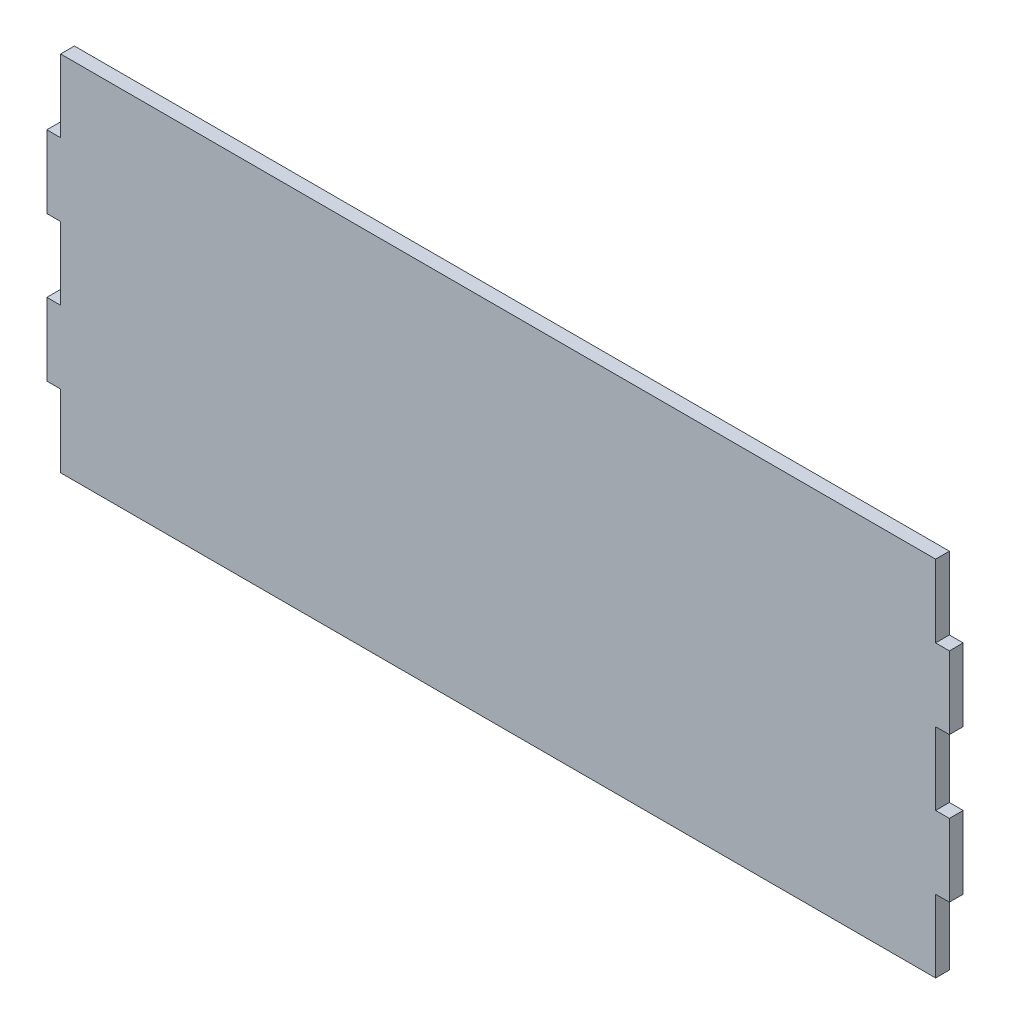
ISO-10303-21;
HEADER;
FILE_DESCRIPTION(('STEP AP214'),'2;1');
FILE_NAME('part.step','',(''),(''),'','','');
FILE_SCHEMA(('AUTOMOTIVE_DESIGN { 1 0 10303 214 1 1 1 1 }'));
ENDSEC;
DATA;
#1=APPLICATION_CONTEXT('core data for automotive mechanical design processes');
#2=APPLICATION_PROTOCOL_DEFINITION('international standard','automotive_design',2000,#1);
#3=PRODUCT_CONTEXT('',#1,'mechanical');
#4=PRODUCT('Part','Part','',(#3));
#5=PRODUCT_RELATED_PRODUCT_CATEGORY('part','',(#4));
#6=PRODUCT_DEFINITION_FORMATION('','',#4);
#7=PRODUCT_DEFINITION_CONTEXT('part definition',#1,'design');
#8=PRODUCT_DEFINITION('design','',#6,#7);
#9=PRODUCT_DEFINITION_SHAPE('','',#8);
#10=(LENGTH_UNIT() NAMED_UNIT(*) SI_UNIT(.MILLI.,.METRE.));
#11=(NAMED_UNIT(*) PLANE_ANGLE_UNIT() SI_UNIT($,.RADIAN.));
#12=(NAMED_UNIT(*) SI_UNIT($,.STERADIAN.) SOLID_ANGLE_UNIT());
#13=UNCERTAINTY_MEASURE_WITH_UNIT(LENGTH_MEASURE(1.E-05),#10,'distance_accuracy_value','');
#14=(GEOMETRIC_REPRESENTATION_CONTEXT(3) GLOBAL_UNCERTAINTY_ASSIGNED_CONTEXT((#13)) GLOBAL_UNIT_ASSIGNED_CONTEXT((#10,
#11,#12)) REPRESENTATION_CONTEXT('',''));
#15=CARTESIAN_POINT('',(0.,0.,0.));
#16=DIRECTION('',(0.,0.,1.));
#17=DIRECTION('',(1.,0.,0.));
#18=AXIS2_PLACEMENT_3D('',#15,#16,#17);
#19=CARTESIAN_POINT('',(311.15,127.,4.826));
#20=DIRECTION('',(-1.,0.,0.));
#21=DIRECTION('',(0.,0.,1.));
#22=AXIS2_PLACEMENT_3D('',#19,#20,#21);
#23=PLANE('',#22);
#24=DIRECTION('',(0.,1.,0.));
#25=VECTOR('',#24,1.);
#26=CARTESIAN_POINT('',(311.15,127.,0.));
#27=LINE('',#26,#25);
#28=CARTESIAN_POINT('',(311.15,101.6,0.));
#29=VERTEX_POINT('',#28);
#30=CARTESIAN_POINT('',(311.15,127.,0.));
#31=VERTEX_POINT('',#30);
#32=EDGE_CURVE('E201',#29,#31,#27,.T.);
#33=ORIENTED_EDGE('',*,*,#32,.T.);
#34=DIRECTION('',(0.,0.,-1.));
#35=VECTOR('',#34,1.);
#36=CARTESIAN_POINT('',(311.15,127.,4.826));
#37=LINE('',#36,#35);
#38=CARTESIAN_POINT('',(311.15,127.,4.826));
#39=VERTEX_POINT('',#38);
#40=EDGE_CURVE('E11',#39,#31,#37,.T.);
#41=ORIENTED_EDGE('',*,*,#40,.F.);
#42=DIRECTION('',(0.,1.,0.));
#43=VECTOR('',#42,1.);
#44=CARTESIAN_POINT('',(311.15,127.,4.826));
#45=LINE('',#44,#43);
#46=CARTESIAN_POINT('',(311.15,101.6,4.826));
#47=VERTEX_POINT('',#46);
#48=EDGE_CURVE('E239',#47,#39,#45,.T.);
#49=ORIENTED_EDGE('',*,*,#48,.F.);
#50=DIRECTION('',(0.,0.,-1.));
#51=VECTOR('',#50,1.);
#52=CARTESIAN_POINT('',(311.15,101.6,4.826));
#53=LINE('',#52,#51);
#54=EDGE_CURVE('E197',#47,#29,#53,.T.);
#55=ORIENTED_EDGE('',*,*,#54,.T.);
#56=EDGE_LOOP('',(#33,#41,#49,#55));
#57=FACE_BOUND('',#56,.T.);
#58=ADVANCED_FACE('F33',(#57),#23,.F.);
#59=CARTESIAN_POINT('',(4.826,127.,4.826));
#60=DIRECTION('',(0.,-1.,0.));
#61=DIRECTION('',(0.,0.,-1.));
#62=AXIS2_PLACEMENT_3D('',#59,#60,#61);
#63=PLANE('',#62);
#64=DIRECTION('',(-1.,0.,0.));
#65=VECTOR('',#64,1.);
#66=CARTESIAN_POINT('',(4.826,127.,0.));
#67=LINE('',#66,#65);
#68=CARTESIAN_POINT('',(4.826,127.,0.));
#69=VERTEX_POINT('',#68);
#70=EDGE_CURVE('E204',#31,#69,#67,.T.);
#71=ORIENTED_EDGE('',*,*,#70,.T.);
#72=DIRECTION('',(0.,0.,-1.));
#73=VECTOR('',#72,1.);
#74=CARTESIAN_POINT('',(4.826,127.,4.826));
#75=LINE('',#74,#73);
#76=CARTESIAN_POINT('',(4.826,127.,4.826));
#77=VERTEX_POINT('',#76);
#78=EDGE_CURVE('E41',#77,#69,#75,.T.);
#79=ORIENTED_EDGE('',*,*,#78,.F.);
#80=DIRECTION('',(-1.,0.,0.));
#81=VECTOR('',#80,1.);
#82=CARTESIAN_POINT('',(4.826,127.,4.826));
#83=LINE('',#82,#81);
#84=EDGE_CURVE('E128',#39,#77,#83,.T.);
#85=ORIENTED_EDGE('',*,*,#84,.F.);
#86=ORIENTED_EDGE('',*,*,#40,.T.);
#87=EDGE_LOOP('',(#71,#79,#85,#86));
#88=FACE_BOUND('',#87,.T.);
#89=ADVANCED_FACE('F357',(#88),#63,.F.);
#90=CARTESIAN_POINT('',(4.826,127.,4.826));
#91=DIRECTION('',(1.,0.,0.));
#92=DIRECTION('',(0.,0.,-1.));
#93=AXIS2_PLACEMENT_3D('',#90,#91,#92);
#94=PLANE('',#93);
#95=DIRECTION('',(0.,-1.,0.));
#96=VECTOR('',#95,1.);
#97=CARTESIAN_POINT('',(4.826,127.,0.));
#98=LINE('',#97,#96);
#99=CARTESIAN_POINT('',(4.826,101.6,0.));
#100=VERTEX_POINT('',#99);
#101=EDGE_CURVE('E206',#69,#100,#98,.T.);
#102=ORIENTED_EDGE('',*,*,#101,.T.);
#103=DIRECTION('',(0.,0.,-1.));
#104=VECTOR('',#103,1.);
#105=CARTESIAN_POINT('',(4.826,101.6,4.826));
#106=LINE('',#105,#104);
#107=CARTESIAN_POINT('',(4.826,101.6,4.826));
#108=VERTEX_POINT('',#107);
#109=EDGE_CURVE('E282',#108,#100,#106,.T.);
#110=ORIENTED_EDGE('',*,*,#109,.F.);
#111=DIRECTION('',(0.,-1.,0.));
#112=VECTOR('',#111,1.);
#113=CARTESIAN_POINT('',(4.826,127.,4.826));
#114=LINE('',#113,#112);
#115=EDGE_CURVE('E290',#77,#108,#114,.T.);
#116=ORIENTED_EDGE('',*,*,#115,.F.);
#117=ORIENTED_EDGE('',*,*,#78,.T.);
#118=EDGE_LOOP('',(#102,#110,#116,#117));
#119=FACE_BOUND('',#118,.T.);
#120=ADVANCED_FACE('F288',(#119),#94,.F.);
#121=CARTESIAN_POINT('',(0.,101.6,4.826));
#122=DIRECTION('',(0.,-1.,0.));
#123=DIRECTION('',(1.,0.,0.));
#124=AXIS2_PLACEMENT_3D('',#121,#122,#123);
#125=PLANE('',#124);
#126=DIRECTION('',(-1.,0.,0.));
#127=VECTOR('',#126,1.);
#128=CARTESIAN_POINT('',(0.,101.6,0.));
#129=LINE('',#128,#127);
#130=CARTESIAN_POINT('',(0.,101.6,0.));
#131=VERTEX_POINT('',#130);
#132=EDGE_CURVE('E208',#100,#131,#129,.T.);
#133=ORIENTED_EDGE('',*,*,#132,.T.);
#134=DIRECTION('',(0.,0.,-1.));
#135=VECTOR('',#134,1.);
#136=CARTESIAN_POINT('',(0.,101.6,4.826));
#137=LINE('',#136,#135);
#138=CARTESIAN_POINT('',(0.,101.6,4.826));
#139=VERTEX_POINT('',#138);
#140=EDGE_CURVE('E279',#139,#131,#137,.T.);
#141=ORIENTED_EDGE('',*,*,#140,.F.);
#142=DIRECTION('',(-1.,0.,0.));
#143=VECTOR('',#142,1.);
#144=CARTESIAN_POINT('',(0.,101.6,4.826));
#145=LINE('',#144,#143);
#146=EDGE_CURVE('E308',#108,#139,#145,.T.);
#147=ORIENTED_EDGE('',*,*,#146,.F.);
#148=ORIENTED_EDGE('',*,*,#109,.T.);
#149=EDGE_LOOP('',(#133,#141,#147,#148));
#150=FACE_BOUND('',#149,.T.);
#151=ADVANCED_FACE('F299',(#150),#125,.F.);
#152=CARTESIAN_POINT('',(0.,101.6,4.826));
#153=DIRECTION('',(1.,0.,0.));
#154=DIRECTION('',(0.,0.,-1.));
#155=AXIS2_PLACEMENT_3D('',#152,#153,#154);
#156=PLANE('',#155);
#157=DIRECTION('',(0.,-1.,0.));
#158=VECTOR('',#157,1.);
#159=CARTESIAN_POINT('',(0.,101.6,0.));
#160=LINE('',#159,#158);
#161=CARTESIAN_POINT('',(0.,76.2,0.));
#162=VERTEX_POINT('',#161);
#163=EDGE_CURVE('E210',#131,#162,#160,.T.);
#164=ORIENTED_EDGE('',*,*,#163,.T.);
#165=DIRECTION('',(0.,0.,-1.));
#166=VECTOR('',#165,1.);
#167=CARTESIAN_POINT('',(0.,76.2,4.826));
#168=LINE('',#167,#166);
#169=CARTESIAN_POINT('',(0.,76.2,4.826));
#170=VERTEX_POINT('',#169);
#171=EDGE_CURVE('E276',#170,#162,#168,.T.);
#172=ORIENTED_EDGE('',*,*,#171,.F.);
#173=DIRECTION('',(0.,-1.,0.));
#174=VECTOR('',#173,1.);
#175=CARTESIAN_POINT('',(0.,101.6,4.826));
#176=LINE('',#175,#174);
#177=EDGE_CURVE('E305',#139,#170,#176,.T.);
#178=ORIENTED_EDGE('',*,*,#177,.F.);
#179=ORIENTED_EDGE('',*,*,#140,.T.);
#180=EDGE_LOOP('',(#164,#172,#178,#179));
#181=FACE_BOUND('',#180,.T.);
#182=ADVANCED_FACE('F303',(#181),#156,.F.);
#183=CARTESIAN_POINT('',(0.,76.2,4.826));
#184=DIRECTION('',(0.,1.,0.));
#185=DIRECTION('',(-1.,0.,0.));
#186=AXIS2_PLACEMENT_3D('',#183,#184,#185);
#187=PLANE('',#186);
#188=DIRECTION('',(1.,0.,0.));
#189=VECTOR('',#188,1.);
#190=CARTESIAN_POINT('',(0.,76.2,0.));
#191=LINE('',#190,#189);
#192=CARTESIAN_POINT('',(4.826,76.2,0.));
#193=VERTEX_POINT('',#192);
#194=EDGE_CURVE('E212',#162,#193,#191,.T.);
#195=ORIENTED_EDGE('',*,*,#194,.T.);
#196=DIRECTION('',(0.,0.,-1.));
#197=VECTOR('',#196,1.);
#198=CARTESIAN_POINT('',(4.826,76.2,4.826));
#199=LINE('',#198,#197);
#200=CARTESIAN_POINT('',(4.826,76.2,4.826));
#201=VERTEX_POINT('',#200);
#202=EDGE_CURVE('E273',#201,#193,#199,.T.);
#203=ORIENTED_EDGE('',*,*,#202,.F.);
#204=DIRECTION('',(1.,0.,0.));
#205=VECTOR('',#204,1.);
#206=CARTESIAN_POINT('',(0.,76.2,4.826));
#207=LINE('',#206,#205);
#208=EDGE_CURVE('E307',#170,#201,#207,.T.);
#209=ORIENTED_EDGE('',*,*,#208,.F.);
#210=ORIENTED_EDGE('',*,*,#171,.T.);
#211=EDGE_LOOP('',(#195,#203,#209,#210));
#212=FACE_BOUND('',#211,.T.);
#213=ADVANCED_FACE('F370',(#212),#187,.F.);
#214=CARTESIAN_POINT('',(4.826,76.2,4.826));
#215=DIRECTION('',(1.,0.,0.));
#216=DIRECTION('',(0.,0.,-1.));
#217=AXIS2_PLACEMENT_3D('',#214,#215,#216);
#218=PLANE('',#217);
#219=DIRECTION('',(0.,-1.,0.));
#220=VECTOR('',#219,1.);
#221=CARTESIAN_POINT('',(4.826,76.2,0.));
#222=LINE('',#221,#220);
#223=CARTESIAN_POINT('',(4.826,50.8,0.));
#224=VERTEX_POINT('',#223);
#225=EDGE_CURVE('E214',#193,#224,#222,.T.);
#226=ORIENTED_EDGE('',*,*,#225,.T.);
#227=DIRECTION('',(0.,0.,-1.));
#228=VECTOR('',#227,1.);
#229=CARTESIAN_POINT('',(4.826,50.8,4.826));
#230=LINE('',#229,#228);
#231=CARTESIAN_POINT('',(4.826,50.8,4.826));
#232=VERTEX_POINT('',#231);
#233=EDGE_CURVE('E270',#232,#224,#230,.T.);
#234=ORIENTED_EDGE('',*,*,#233,.F.);
#235=DIRECTION('',(0.,-1.,0.));
#236=VECTOR('',#235,1.);
#237=CARTESIAN_POINT('',(4.826,76.2,4.826));
#238=LINE('',#237,#236);
#239=EDGE_CURVE('E310',#201,#232,#238,.T.);
#240=ORIENTED_EDGE('',*,*,#239,.F.);
#241=ORIENTED_EDGE('',*,*,#202,.T.);
#242=EDGE_LOOP('',(#226,#234,#240,#241));
#243=FACE_BOUND('',#242,.T.);
#244=ADVANCED_FACE('F373',(#243),#218,.F.);
#245=CARTESIAN_POINT('',(4.826,50.8,4.826));
#246=DIRECTION('',(0.,-1.,0.));
#247=DIRECTION('',(0.,0.,-1.));
#248=AXIS2_PLACEMENT_3D('',#245,#246,#247);
#249=PLANE('',#248);
#250=DIRECTION('',(-1.,0.,0.));
#251=VECTOR('',#250,1.);
#252=CARTESIAN_POINT('',(4.826,50.8,0.));
#253=LINE('',#252,#251);
#254=CARTESIAN_POINT('',(0.,50.8,0.));
#255=VERTEX_POINT('',#254);
#256=EDGE_CURVE('E216',#224,#255,#253,.T.);
#257=ORIENTED_EDGE('',*,*,#256,.T.);
#258=DIRECTION('',(0.,0.,-1.));
#259=VECTOR('',#258,1.);
#260=CARTESIAN_POINT('',(0.,50.8,4.826));
#261=LINE('',#260,#259);
#262=CARTESIAN_POINT('',(0.,50.8,4.826));
#263=VERTEX_POINT('',#262);
#264=EDGE_CURVE('E267',#263,#255,#261,.T.);
#265=ORIENTED_EDGE('',*,*,#264,.F.);
#266=DIRECTION('',(-1.,0.,0.));
#267=VECTOR('',#266,1.);
#268=CARTESIAN_POINT('',(4.826,50.8,4.826));
#269=LINE('',#268,#267);
#270=EDGE_CURVE('E316',#232,#263,#269,.T.);
#271=ORIENTED_EDGE('',*,*,#270,.F.);
#272=ORIENTED_EDGE('',*,*,#233,.T.);
#273=EDGE_LOOP('',(#257,#265,#271,#272));
#274=FACE_BOUND('',#273,.T.);
#275=ADVANCED_FACE('F377',(#274),#249,.F.);
#276=CARTESIAN_POINT('',(0.,50.8,4.826));
#277=DIRECTION('',(1.,0.,0.));
#278=DIRECTION('',(0.,0.,-1.));
#279=AXIS2_PLACEMENT_3D('',#276,#277,#278);
#280=PLANE('',#279);
#281=DIRECTION('',(0.,-1.,0.));
#282=VECTOR('',#281,1.);
#283=CARTESIAN_POINT('',(0.,50.8,0.));
#284=LINE('',#283,#282);
#285=CARTESIAN_POINT('',(0.,25.4,0.));
#286=VERTEX_POINT('',#285);
#287=EDGE_CURVE('E218',#255,#286,#284,.T.);
#288=ORIENTED_EDGE('',*,*,#287,.T.);
#289=DIRECTION('',(0.,0.,-1.));
#290=VECTOR('',#289,1.);
#291=CARTESIAN_POINT('',(0.,25.4,4.826));
#292=LINE('',#291,#290);
#293=CARTESIAN_POINT('',(0.,25.4,4.826));
#294=VERTEX_POINT('',#293);
#295=EDGE_CURVE('E264',#294,#286,#292,.T.);
#296=ORIENTED_EDGE('',*,*,#295,.F.);
#297=DIRECTION('',(0.,-1.,0.));
#298=VECTOR('',#297,1.);
#299=CARTESIAN_POINT('',(0.,50.8,4.826));
#300=LINE('',#299,#298);
#301=EDGE_CURVE('E318',#263,#294,#300,.T.);
#302=ORIENTED_EDGE('',*,*,#301,.F.);
#303=ORIENTED_EDGE('',*,*,#264,.T.);
#304=EDGE_LOOP('',(#288,#296,#302,#303));
#305=FACE_BOUND('',#304,.T.);
#306=ADVANCED_FACE('F381',(#305),#280,.F.);
#307=CARTESIAN_POINT('',(4.826,25.4,4.826));
#308=DIRECTION('',(0.,1.,0.));
#309=DIRECTION('',(0.,0.,1.));
#310=AXIS2_PLACEMENT_3D('',#307,#308,#309);
#311=PLANE('',#310);
#312=DIRECTION('',(1.,0.,0.));
#313=VECTOR('',#312,1.);
#314=CARTESIAN_POINT('',(4.826,25.4,0.));
#315=LINE('',#314,#313);
#316=CARTESIAN_POINT('',(4.826,25.4,0.));
#317=VERTEX_POINT('',#316);
#318=EDGE_CURVE('E220',#286,#317,#315,.T.);
#319=ORIENTED_EDGE('',*,*,#318,.T.);
#320=DIRECTION('',(0.,0.,-1.));
#321=VECTOR('',#320,1.);
#322=CARTESIAN_POINT('',(4.826,25.4,4.826));
#323=LINE('',#322,#321);
#324=CARTESIAN_POINT('',(4.826,25.4,4.826));
#325=VERTEX_POINT('',#324);
#326=EDGE_CURVE('E261',#325,#317,#323,.T.);
#327=ORIENTED_EDGE('',*,*,#326,.F.);
#328=DIRECTION('',(1.,0.,0.));
#329=VECTOR('',#328,1.);
#330=CARTESIAN_POINT('',(4.826,25.4,4.826));
#331=LINE('',#330,#329);
#332=EDGE_CURVE('E320',#294,#325,#331,.T.);
#333=ORIENTED_EDGE('',*,*,#332,.F.);
#334=ORIENTED_EDGE('',*,*,#295,.T.);
#335=EDGE_LOOP('',(#319,#327,#333,#334));
#336=FACE_BOUND('',#335,.T.);
#337=ADVANCED_FACE('F385',(#336),#311,.F.);
#338=CARTESIAN_POINT('',(4.826,25.4,4.826));
#339=DIRECTION('',(1.,0.,0.));
#340=DIRECTION('',(0.,0.,-1.));
#341=AXIS2_PLACEMENT_3D('',#338,#339,#340);
#342=PLANE('',#341);
#343=DIRECTION('',(0.,-1.,0.));
#344=VECTOR('',#343,1.);
#345=CARTESIAN_POINT('',(4.826,25.4,0.));
#346=LINE('',#345,#344);
#347=CARTESIAN_POINT('',(4.826,0.,0.));
#348=VERTEX_POINT('',#347);
#349=EDGE_CURVE('E222',#317,#348,#346,.T.);
#350=ORIENTED_EDGE('',*,*,#349,.T.);
#351=DIRECTION('',(0.,0.,-1.));
#352=VECTOR('',#351,1.);
#353=CARTESIAN_POINT('',(4.826,0.,4.826));
#354=LINE('',#353,#352);
#355=CARTESIAN_POINT('',(4.826,0.,4.826));
#356=VERTEX_POINT('',#355);
#357=EDGE_CURVE('E258',#356,#348,#354,.T.);
#358=ORIENTED_EDGE('',*,*,#357,.F.);
#359=DIRECTION('',(0.,-1.,0.));
#360=VECTOR('',#359,1.);
#361=CARTESIAN_POINT('',(4.826,25.4,4.826));
#362=LINE('',#361,#360);
#363=EDGE_CURVE('E322',#325,#356,#362,.T.);
#364=ORIENTED_EDGE('',*,*,#363,.F.);
#365=ORIENTED_EDGE('',*,*,#326,.T.);
#366=EDGE_LOOP('',(#350,#358,#364,#365));
#367=FACE_BOUND('',#366,.T.);
#368=ADVANCED_FACE('F389',(#367),#342,.F.);
#369=CARTESIAN_POINT('',(4.826,0.,4.826));
#370=DIRECTION('',(0.,1.,0.));
#371=DIRECTION('',(0.,0.,1.));
#372=AXIS2_PLACEMENT_3D('',#369,#370,#371);
#373=PLANE('',#372);
#374=DIRECTION('',(1.,0.,0.));
#375=VECTOR('',#374,1.);
#376=CARTESIAN_POINT('',(4.826,0.,0.));
#377=LINE('',#376,#375);
#378=CARTESIAN_POINT('',(311.15,0.,0.));
#379=VERTEX_POINT('',#378);
#380=EDGE_CURVE('E224',#348,#379,#377,.T.);
#381=ORIENTED_EDGE('',*,*,#380,.T.);
#382=DIRECTION('',(0.,0.,-1.));
#383=VECTOR('',#382,1.);
#384=CARTESIAN_POINT('',(311.15,0.,4.826));
#385=LINE('',#384,#383);
#386=CARTESIAN_POINT('',(311.15,0.,4.826));
#387=VERTEX_POINT('',#386);
#388=EDGE_CURVE('E255',#387,#379,#385,.T.);
#389=ORIENTED_EDGE('',*,*,#388,.F.);
#390=DIRECTION('',(1.,0.,0.));
#391=VECTOR('',#390,1.);
#392=CARTESIAN_POINT('',(4.826,0.,4.826));
#393=LINE('',#392,#391);
#394=EDGE_CURVE('E324',#356,#387,#393,.T.);
#395=ORIENTED_EDGE('',*,*,#394,.F.);
#396=ORIENTED_EDGE('',*,*,#357,.T.);
#397=EDGE_LOOP('',(#381,#389,#395,#396));
#398=FACE_BOUND('',#397,.T.);
#399=ADVANCED_FACE('F393',(#398),#373,.F.);
#400=CARTESIAN_POINT('',(311.15,25.4,4.826));
#401=DIRECTION('',(-1.,0.,0.));
#402=DIRECTION('',(0.,0.,1.));
#403=AXIS2_PLACEMENT_3D('',#400,#401,#402);
#404=PLANE('',#403);
#405=DIRECTION('',(0.,1.,0.));
#406=VECTOR('',#405,1.);
#407=CARTESIAN_POINT('',(311.15,25.4,0.));
#408=LINE('',#407,#406);
#409=CARTESIAN_POINT('',(311.15,25.4,0.));
#410=VERTEX_POINT('',#409);
#411=EDGE_CURVE('E226',#379,#410,#408,.T.);
#412=ORIENTED_EDGE('',*,*,#411,.T.);
#413=DIRECTION('',(0.,0.,-1.));
#414=VECTOR('',#413,1.);
#415=CARTESIAN_POINT('',(311.15,25.4,4.826));
#416=LINE('',#415,#414);
#417=CARTESIAN_POINT('',(311.15,25.4,4.826));
#418=VERTEX_POINT('',#417);
#419=EDGE_CURVE('E252',#418,#410,#416,.T.);
#420=ORIENTED_EDGE('',*,*,#419,.F.);
#421=DIRECTION('',(0.,1.,0.));
#422=VECTOR('',#421,1.);
#423=CARTESIAN_POINT('',(311.15,25.4,4.826));
#424=LINE('',#423,#422);
#425=EDGE_CURVE('E326',#387,#418,#424,.T.);
#426=ORIENTED_EDGE('',*,*,#425,.F.);
#427=ORIENTED_EDGE('',*,*,#388,.T.);
#428=EDGE_LOOP('',(#412,#420,#426,#427));
#429=FACE_BOUND('',#428,.T.);
#430=ADVANCED_FACE('F397',(#429),#404,.F.);
#431=CARTESIAN_POINT('',(311.15,25.4,4.826));
#432=DIRECTION('',(0.,1.,0.));
#433=DIRECTION('',(-1.,0.,0.));
#434=AXIS2_PLACEMENT_3D('',#431,#432,#433);
#435=PLANE('',#434);
#436=DIRECTION('',(1.,0.,0.));
#437=VECTOR('',#436,1.);
#438=CARTESIAN_POINT('',(311.15,25.4,0.));
#439=LINE('',#438,#437);
#440=CARTESIAN_POINT('',(315.976,25.4,0.));
#441=VERTEX_POINT('',#440);
#442=EDGE_CURVE('E228',#410,#441,#439,.T.);
#443=ORIENTED_EDGE('',*,*,#442,.T.);
#444=DIRECTION('',(0.,0.,-1.));
#445=VECTOR('',#444,1.);
#446=CARTESIAN_POINT('',(315.976,25.4,4.826));
#447=LINE('',#446,#445);
#448=CARTESIAN_POINT('',(315.976,25.4,4.826));
#449=VERTEX_POINT('',#448);
#450=EDGE_CURVE('E249',#449,#441,#447,.T.);
#451=ORIENTED_EDGE('',*,*,#450,.F.);
#452=DIRECTION('',(1.,0.,0.));
#453=VECTOR('',#452,1.);
#454=CARTESIAN_POINT('',(311.15,25.4,4.826));
#455=LINE('',#454,#453);
#456=EDGE_CURVE('E328',#418,#449,#455,.T.);
#457=ORIENTED_EDGE('',*,*,#456,.F.);
#458=ORIENTED_EDGE('',*,*,#419,.T.);
#459=EDGE_LOOP('',(#443,#451,#457,#458));
#460=FACE_BOUND('',#459,.T.);
#461=ADVANCED_FACE('F401',(#460),#435,.F.);
#462=CARTESIAN_POINT('',(315.976,50.8,4.826));
#463=DIRECTION('',(-1.,0.,0.));
#464=DIRECTION('',(0.,0.,1.));
#465=AXIS2_PLACEMENT_3D('',#462,#463,#464);
#466=PLANE('',#465);
#467=DIRECTION('',(0.,1.,0.));
#468=VECTOR('',#467,1.);
#469=CARTESIAN_POINT('',(315.976,50.8,0.));
#470=LINE('',#469,#468);
#471=CARTESIAN_POINT('',(315.976,50.8,0.));
#472=VERTEX_POINT('',#471);
#473=EDGE_CURVE('E230',#441,#472,#470,.T.);
#474=ORIENTED_EDGE('',*,*,#473,.T.);
#475=DIRECTION('',(0.,0.,-1.));
#476=VECTOR('',#475,1.);
#477=CARTESIAN_POINT('',(315.976,50.8,4.826));
#478=LINE('',#477,#476);
#479=CARTESIAN_POINT('',(315.976,50.8,4.826));
#480=VERTEX_POINT('',#479);
#481=EDGE_CURVE('E246',#480,#472,#478,.T.);
#482=ORIENTED_EDGE('',*,*,#481,.F.);
#483=DIRECTION('',(0.,1.,0.));
#484=VECTOR('',#483,1.);
#485=CARTESIAN_POINT('',(315.976,50.8,4.826));
#486=LINE('',#485,#484);
#487=EDGE_CURVE('E330',#449,#480,#486,.T.);
#488=ORIENTED_EDGE('',*,*,#487,.F.);
#489=ORIENTED_EDGE('',*,*,#450,.T.);
#490=EDGE_LOOP('',(#474,#482,#488,#489));
#491=FACE_BOUND('',#490,.T.);
#492=ADVANCED_FACE('F405',(#491),#466,.F.);
#493=CARTESIAN_POINT('',(311.15,50.8,4.826));
#494=DIRECTION('',(0.,-1.,0.));
#495=DIRECTION('',(1.,0.,0.));
#496=AXIS2_PLACEMENT_3D('',#493,#494,#495);
#497=PLANE('',#496);
#498=DIRECTION('',(-1.,0.,0.));
#499=VECTOR('',#498,1.);
#500=CARTESIAN_POINT('',(311.15,50.8,0.));
#501=LINE('',#500,#499);
#502=CARTESIAN_POINT('',(311.15,50.8,0.));
#503=VERTEX_POINT('',#502);
#504=EDGE_CURVE('E232',#472,#503,#501,.T.);
#505=ORIENTED_EDGE('',*,*,#504,.T.);
#506=DIRECTION('',(0.,0.,-1.));
#507=VECTOR('',#506,1.);
#508=CARTESIAN_POINT('',(311.15,50.8,4.826));
#509=LINE('',#508,#507);
#510=CARTESIAN_POINT('',(311.15,50.8,4.826));
#511=VERTEX_POINT('',#510);
#512=EDGE_CURVE('E243',#511,#503,#509,.T.);
#513=ORIENTED_EDGE('',*,*,#512,.F.);
#514=DIRECTION('',(-1.,0.,0.));
#515=VECTOR('',#514,1.);
#516=CARTESIAN_POINT('',(311.15,50.8,4.826));
#517=LINE('',#516,#515);
#518=EDGE_CURVE('E332',#480,#511,#517,.T.);
#519=ORIENTED_EDGE('',*,*,#518,.F.);
#520=ORIENTED_EDGE('',*,*,#481,.T.);
#521=EDGE_LOOP('',(#505,#513,#519,#520));
#522=FACE_BOUND('',#521,.T.);
#523=ADVANCED_FACE('F338',(#522),#497,.F.);
#524=CARTESIAN_POINT('',(311.15,76.2,4.826));
#525=DIRECTION('',(-1.,0.,0.));
#526=DIRECTION('',(0.,0.,1.));
#527=AXIS2_PLACEMENT_3D('',#524,#525,#526);
#528=PLANE('',#527);
#529=DIRECTION('',(0.,1.,0.));
#530=VECTOR('',#529,1.);
#531=CARTESIAN_POINT('',(311.15,76.2,0.));
#532=LINE('',#531,#530);
#533=CARTESIAN_POINT('',(311.15,76.2,0.));
#534=VERTEX_POINT('',#533);
#535=EDGE_CURVE('E234',#503,#534,#532,.T.);
#536=ORIENTED_EDGE('',*,*,#535,.T.);
#537=DIRECTION('',(0.,0.,-1.));
#538=VECTOR('',#537,1.);
#539=CARTESIAN_POINT('',(311.15,76.2,4.826));
#540=LINE('',#539,#538);
#541=CARTESIAN_POINT('',(311.15,76.2,4.826));
#542=VERTEX_POINT('',#541);
#543=EDGE_CURVE('E192',#542,#534,#540,.T.);
#544=ORIENTED_EDGE('',*,*,#543,.F.);
#545=DIRECTION('',(0.,1.,0.));
#546=VECTOR('',#545,1.);
#547=CARTESIAN_POINT('',(311.15,76.2,4.826));
#548=LINE('',#547,#546);
#549=EDGE_CURVE('E183',#511,#542,#548,.T.);
#550=ORIENTED_EDGE('',*,*,#549,.F.);
#551=ORIENTED_EDGE('',*,*,#512,.T.);
#552=EDGE_LOOP('',(#536,#544,#550,#551));
#553=FACE_BOUND('',#552,.T.);
#554=ADVANCED_FACE('F342',(#553),#528,.F.);
#555=CARTESIAN_POINT('',(311.15,76.2,4.826));
#556=DIRECTION('',(0.,1.,0.));
#557=DIRECTION('',(-1.,0.,0.));
#558=AXIS2_PLACEMENT_3D('',#555,#556,#557);
#559=PLANE('',#558);
#560=DIRECTION('',(1.,0.,0.));
#561=VECTOR('',#560,1.);
#562=CARTESIAN_POINT('',(311.15,76.2,0.));
#563=LINE('',#562,#561);
#564=CARTESIAN_POINT('',(315.976,76.2,0.));
#565=VERTEX_POINT('',#564);
#566=EDGE_CURVE('E191',#534,#565,#563,.T.);
#567=ORIENTED_EDGE('',*,*,#566,.T.);
#568=DIRECTION('',(0.,0.,-1.));
#569=VECTOR('',#568,1.);
#570=CARTESIAN_POINT('',(315.976,76.2,4.826));
#571=LINE('',#570,#569);
#572=CARTESIAN_POINT('',(315.976,76.2,4.826));
#573=VERTEX_POINT('',#572);
#574=EDGE_CURVE('E188',#573,#565,#571,.T.);
#575=ORIENTED_EDGE('',*,*,#574,.F.);
#576=DIRECTION('',(1.,0.,0.));
#577=VECTOR('',#576,1.);
#578=CARTESIAN_POINT('',(311.15,76.2,4.826));
#579=LINE('',#578,#577);
#580=EDGE_CURVE('E177',#542,#573,#579,.T.);
#581=ORIENTED_EDGE('',*,*,#580,.F.);
#582=ORIENTED_EDGE('',*,*,#543,.T.);
#583=EDGE_LOOP('',(#567,#575,#581,#582));
#584=FACE_BOUND('',#583,.T.);
#585=ADVANCED_FACE('F189',(#584),#559,.F.);
#586=CARTESIAN_POINT('',(315.976,101.6,4.826));
#587=DIRECTION('',(-1.,0.,0.));
#588=DIRECTION('',(0.,0.,1.));
#589=AXIS2_PLACEMENT_3D('',#586,#587,#588);
#590=PLANE('',#589);
#591=DIRECTION('',(0.,1.,0.));
#592=VECTOR('',#591,1.);
#593=CARTESIAN_POINT('',(315.976,101.6,0.));
#594=LINE('',#593,#592);
#595=CARTESIAN_POINT('',(315.976,101.6,0.));
#596=VERTEX_POINT('',#595);
#597=EDGE_CURVE('E114',#565,#596,#594,.T.);
#598=ORIENTED_EDGE('',*,*,#597,.T.);
#599=DIRECTION('',(0.,0.,-1.));
#600=VECTOR('',#599,1.);
#601=CARTESIAN_POINT('',(315.976,101.6,4.826));
#602=LINE('',#601,#600);
#603=CARTESIAN_POINT('',(315.976,101.6,4.826));
#604=VERTEX_POINT('',#603);
#605=EDGE_CURVE('E193',#604,#596,#602,.T.);
#606=ORIENTED_EDGE('',*,*,#605,.F.);
#607=DIRECTION('',(0.,1.,0.));
#608=VECTOR('',#607,1.);
#609=CARTESIAN_POINT('',(315.976,101.6,4.826));
#610=LINE('',#609,#608);
#611=EDGE_CURVE('E181',#573,#604,#610,.T.);
#612=ORIENTED_EDGE('',*,*,#611,.F.);
#613=ORIENTED_EDGE('',*,*,#574,.T.);
#614=EDGE_LOOP('',(#598,#606,#612,#613));
#615=FACE_BOUND('',#614,.T.);
#616=ADVANCED_FACE('F195',(#615),#590,.F.);
#617=CARTESIAN_POINT('',(311.15,101.6,4.826));
#618=DIRECTION('',(0.,-1.,0.));
#619=DIRECTION('',(0.,0.,-1.));
#620=AXIS2_PLACEMENT_3D('',#617,#618,#619);
#621=PLANE('',#620);
#622=DIRECTION('',(-1.,0.,0.));
#623=VECTOR('',#622,1.);
#624=CARTESIAN_POINT('',(311.15,101.6,0.));
#625=LINE('',#624,#623);
#626=EDGE_CURVE('E120',#596,#29,#625,.T.);
#627=ORIENTED_EDGE('',*,*,#626,.T.);
#628=ORIENTED_EDGE('',*,*,#54,.F.);
#629=DIRECTION('',(-1.,0.,0.));
#630=VECTOR('',#629,1.);
#631=CARTESIAN_POINT('',(311.15,101.6,4.826));
#632=LINE('',#631,#630);
#633=EDGE_CURVE('E49',#604,#47,#632,.T.);
#634=ORIENTED_EDGE('',*,*,#633,.F.);
#635=ORIENTED_EDGE('',*,*,#605,.T.);
#636=EDGE_LOOP('',(#627,#628,#634,#635));
#637=FACE_BOUND('',#636,.T.);
#638=ADVANCED_FACE('F346',(#637),#621,.F.);
#639=CARTESIAN_POINT('',(0.,0.,4.826));
#640=DIRECTION('',(0.,0.,1.));
#641=DIRECTION('',(1.,0.,0.));
#642=AXIS2_PLACEMENT_3D('',#639,#640,#641);
#643=PLANE('',#642);
#644=ORIENTED_EDGE('',*,*,#48,.T.);
#645=ORIENTED_EDGE('',*,*,#84,.T.);
#646=ORIENTED_EDGE('',*,*,#115,.T.);
#647=ORIENTED_EDGE('',*,*,#146,.T.);
#648=ORIENTED_EDGE('',*,*,#177,.T.);
#649=ORIENTED_EDGE('',*,*,#208,.T.);
#650=ORIENTED_EDGE('',*,*,#239,.T.);
#651=ORIENTED_EDGE('',*,*,#270,.T.);
#652=ORIENTED_EDGE('',*,*,#301,.T.);
#653=ORIENTED_EDGE('',*,*,#332,.T.);
#654=ORIENTED_EDGE('',*,*,#363,.T.);
#655=ORIENTED_EDGE('',*,*,#394,.T.);
#656=ORIENTED_EDGE('',*,*,#425,.T.);
#657=ORIENTED_EDGE('',*,*,#456,.T.);
#658=ORIENTED_EDGE('',*,*,#487,.T.);
#659=ORIENTED_EDGE('',*,*,#518,.T.);
#660=ORIENTED_EDGE('',*,*,#549,.T.);
#661=ORIENTED_EDGE('',*,*,#580,.T.);
#662=ORIENTED_EDGE('',*,*,#611,.T.);
#663=ORIENTED_EDGE('',*,*,#633,.T.);
#664=EDGE_LOOP('',(#644,#645,#646,#647,#648,#649,#650,#651,#652,#653,#654,#655,#656,#657,#658,
#659,#660,#661,#662,#663));
#665=FACE_BOUND('',#664,.T.);
#666=ADVANCED_FACE('F179',(#665),#643,.T.);
#667=CARTESIAN_POINT('',(0.,0.,0.));
#668=DIRECTION('',(0.,0.,1.));
#669=DIRECTION('',(1.,0.,0.));
#670=AXIS2_PLACEMENT_3D('',#667,#668,#669);
#671=PLANE('',#670);
#672=ORIENTED_EDGE('',*,*,#32,.F.);
#673=ORIENTED_EDGE('',*,*,#626,.F.);
#674=ORIENTED_EDGE('',*,*,#597,.F.);
#675=ORIENTED_EDGE('',*,*,#566,.F.);
#676=ORIENTED_EDGE('',*,*,#535,.F.);
#677=ORIENTED_EDGE('',*,*,#504,.F.);
#678=ORIENTED_EDGE('',*,*,#473,.F.);
#679=ORIENTED_EDGE('',*,*,#442,.F.);
#680=ORIENTED_EDGE('',*,*,#411,.F.);
#681=ORIENTED_EDGE('',*,*,#380,.F.);
#682=ORIENTED_EDGE('',*,*,#349,.F.);
#683=ORIENTED_EDGE('',*,*,#318,.F.);
#684=ORIENTED_EDGE('',*,*,#287,.F.);
#685=ORIENTED_EDGE('',*,*,#256,.F.);
#686=ORIENTED_EDGE('',*,*,#225,.F.);
#687=ORIENTED_EDGE('',*,*,#194,.F.);
#688=ORIENTED_EDGE('',*,*,#163,.F.);
#689=ORIENTED_EDGE('',*,*,#132,.F.);
#690=ORIENTED_EDGE('',*,*,#101,.F.);
#691=ORIENTED_EDGE('',*,*,#70,.F.);
#692=EDGE_LOOP('',(#672,#673,#674,#675,#676,#677,#678,#679,#680,#681,#682,#683,#684,#685,#686,
#687,#688,#689,#690,#691));
#693=FACE_BOUND('',#692,.T.);
#694=ADVANCED_FACE('F294',(#693),#671,.F.);
#695=CLOSED_SHELL('',(#58,#89,#120,#151,#182,#213,#244,#275,#306,#337,#368,#399,#430,#461,#492,
#523,#554,#585,#616,#638,#666,#694));
#696=MANIFOLD_SOLID_BREP('B2',#695);
#697=ADVANCED_BREP_SHAPE_REPRESENTATION('',(#18,#696),#14);
#698=SHAPE_DEFINITION_REPRESENTATION(#9,#697);
ENDSEC;
END-ISO-10303-21;
